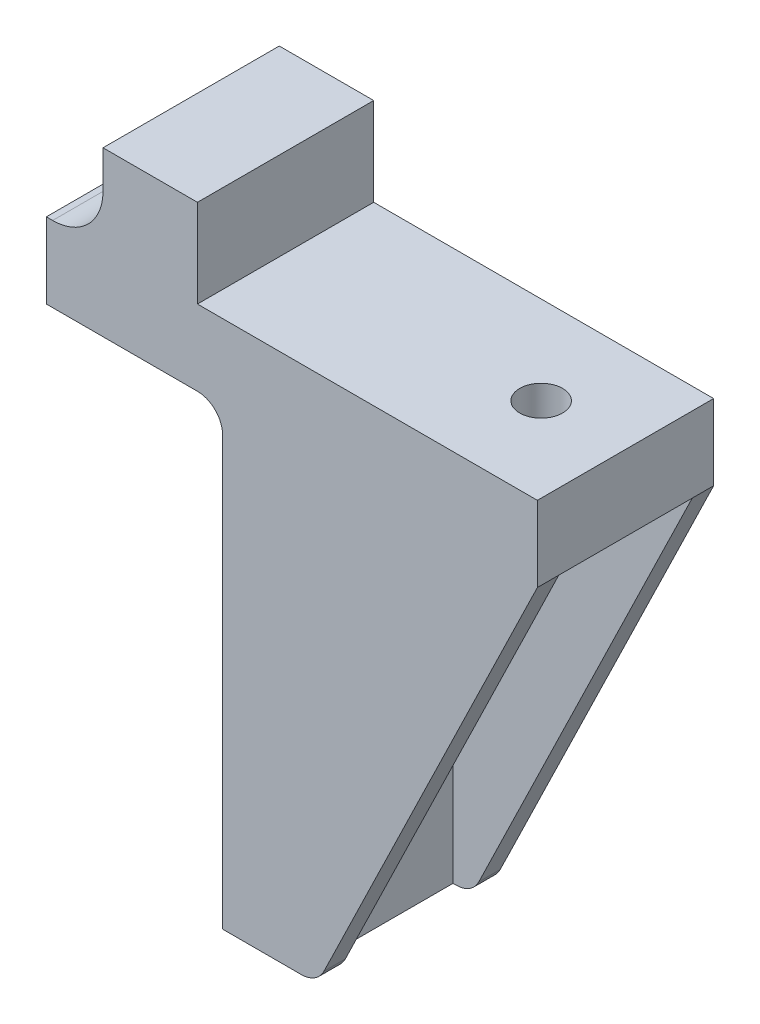
ISO-10303-21;
HEADER;
FILE_DESCRIPTION(('STEP AP214'),'2;1');
FILE_NAME('part.step','',(''),(''),'','','');
FILE_SCHEMA(('AUTOMOTIVE_DESIGN { 1 0 10303 214 1 1 1 1 }'));
ENDSEC;
DATA;
#1=APPLICATION_CONTEXT('core data for automotive mechanical design processes');
#2=APPLICATION_PROTOCOL_DEFINITION('international standard','automotive_design',2000,#1);
#3=PRODUCT_CONTEXT('',#1,'mechanical');
#4=PRODUCT('Part','Part','',(#3));
#5=PRODUCT_RELATED_PRODUCT_CATEGORY('part','',(#4));
#6=PRODUCT_DEFINITION_FORMATION('','',#4);
#7=PRODUCT_DEFINITION_CONTEXT('part definition',#1,'design');
#8=PRODUCT_DEFINITION('design','',#6,#7);
#9=PRODUCT_DEFINITION_SHAPE('','',#8);
#10=(LENGTH_UNIT() NAMED_UNIT(*) SI_UNIT(.MILLI.,.METRE.));
#11=(NAMED_UNIT(*) PLANE_ANGLE_UNIT() SI_UNIT($,.RADIAN.));
#12=(NAMED_UNIT(*) SI_UNIT($,.STERADIAN.) SOLID_ANGLE_UNIT());
#13=UNCERTAINTY_MEASURE_WITH_UNIT(LENGTH_MEASURE(1.E-05),#10,'distance_accuracy_value','');
#14=(GEOMETRIC_REPRESENTATION_CONTEXT(3) GLOBAL_UNCERTAINTY_ASSIGNED_CONTEXT((#13)) GLOBAL_UNIT_ASSIGNED_CONTEXT((#10,
#11,#12)) REPRESENTATION_CONTEXT('',''));
#15=CARTESIAN_POINT('',(0.,0.,0.));
#16=DIRECTION('',(0.,0.,1.));
#17=DIRECTION('',(1.,0.,0.));
#18=AXIS2_PLACEMENT_3D('',#15,#16,#17);
#19=CARTESIAN_POINT('',(0.,0.,14.));
#20=DIRECTION('',(0.,-1.,0.));
#21=DIRECTION('',(0.,0.,-1.));
#22=AXIS2_PLACEMENT_3D('',#19,#20,#21);
#23=PLANE('',#22);
#24=CARTESIAN_POINT('',(18.3,0.,7.));
#25=DIRECTION('',(0.,-1.,0.));
#26=DIRECTION('',(0.,0.,-1.));
#27=AXIS2_PLACEMENT_3D('',#24,#25,#26);
#28=CIRCLE('',#27,1.7);
#29=CARTESIAN_POINT('',(18.3,0.,5.3));
#30=VERTEX_POINT('',#29);
#31=EDGE_CURVE('E489',#30,#30,#28,.T.);
#32=ORIENTED_EDGE('',*,*,#31,.T.);
#33=EDGE_LOOP('',(#32));
#34=FACE_BOUND('',#33,.T.);
#35=DIRECTION('',(0.,0.,-1.));
#36=VECTOR('',#35,1.);
#37=CARTESIAN_POINT('',(-2.,0.,14.));
#38=LINE('',#37,#36);
#39=CARTESIAN_POINT('',(-2.,0.,14.));
#40=VERTEX_POINT('',#39);
#41=CARTESIAN_POINT('',(-2.,0.,0.));
#42=VERTEX_POINT('',#41);
#43=EDGE_CURVE('E226',#40,#42,#38,.T.);
#44=ORIENTED_EDGE('',*,*,#43,.F.);
#45=DIRECTION('',(-1.,0.,0.));
#46=VECTOR('',#45,1.);
#47=CARTESIAN_POINT('',(0.,0.,14.));
#48=LINE('',#47,#46);
#49=CARTESIAN_POINT('',(25.,0.,14.));
#50=VERTEX_POINT('',#49);
#51=EDGE_CURVE('E565',#50,#40,#48,.T.);
#52=ORIENTED_EDGE('',*,*,#51,.F.);
#53=DIRECTION('',(0.,0.,-1.));
#54=VECTOR('',#53,1.);
#55=CARTESIAN_POINT('',(25.,0.,14.));
#56=LINE('',#55,#54);
#57=CARTESIAN_POINT('',(25.,0.,0.));
#58=VERTEX_POINT('',#57);
#59=EDGE_CURVE('E498',#50,#58,#56,.T.);
#60=ORIENTED_EDGE('',*,*,#59,.T.);
#61=DIRECTION('',(-1.,0.,0.));
#62=VECTOR('',#61,1.);
#63=CARTESIAN_POINT('',(0.,0.,0.));
#64=LINE('',#63,#62);
#65=EDGE_CURVE('E333',#58,#42,#64,.T.);
#66=ORIENTED_EDGE('',*,*,#65,.T.);
#67=EDGE_LOOP('',(#44,#52,#60,#66));
#68=FACE_BOUND('',#67,.T.);
#69=ADVANCED_FACE('F49',(#34,#68),#23,.F.);
#70=CARTESIAN_POINT('',(6.,-6.,14.));
#71=DIRECTION('',(-1.,0.,0.));
#72=DIRECTION('',(0.,-1.,0.));
#73=AXIS2_PLACEMENT_3D('',#70,#71,#72);
#74=PLANE('',#73);
#75=CARTESIAN_POINT('',(5.99999999999999,-34.058,6.99999999999999));
#76=DIRECTION('',(1.,0.,0.));
#77=DIRECTION('',(0.,1.,0.));
#78=AXIS2_PLACEMENT_3D('',#75,#76,#77);
#79=CIRCLE('',#78,1.7);
#80=CARTESIAN_POINT('',(5.99999999999999,-32.358,6.99999999999999));
#81=VERTEX_POINT('',#80);
#82=EDGE_CURVE('E492',#81,#81,#79,.T.);
#83=ORIENTED_EDGE('',*,*,#82,.F.);
#84=EDGE_LOOP('',(#83));
#85=FACE_BOUND('',#84,.T.);
#86=CARTESIAN_POINT('',(5.99999999999999,-17.78,7.));
#87=DIRECTION('',(1.,0.,0.));
#88=DIRECTION('',(0.,1.,0.));
#89=AXIS2_PLACEMENT_3D('',#86,#87,#88);
#90=CIRCLE('',#89,1.7);
#91=CARTESIAN_POINT('',(5.99999999999999,-16.08,7.));
#92=VERTEX_POINT('',#91);
#93=EDGE_CURVE('E559',#92,#92,#90,.T.);
#94=ORIENTED_EDGE('',*,*,#93,.F.);
#95=EDGE_LOOP('',(#94));
#96=FACE_BOUND('',#95,.T.);
#97=DIRECTION('',(0.,-1.,0.));
#98=VECTOR('',#97,1.);
#99=CARTESIAN_POINT('',(6.,-6.,1.7));
#100=LINE('',#99,#98);
#101=CARTESIAN_POINT('',(6.,-14.,1.7));
#102=VERTEX_POINT('',#101);
#103=CARTESIAN_POINT('',(6.00000000000001,-42.,1.7));
#104=VERTEX_POINT('',#103);
#105=EDGE_CURVE('E239',#102,#104,#100,.T.);
#106=ORIENTED_EDGE('',*,*,#105,.F.);
#107=DIRECTION('',(0.,0.,-1.));
#108=VECTOR('',#107,1.);
#109=CARTESIAN_POINT('',(6.,-14.,12.3));
#110=LINE('',#109,#108);
#111=CARTESIAN_POINT('',(6.00000000000001,-14.,12.3));
#112=VERTEX_POINT('',#111);
#113=EDGE_CURVE('E257',#102,#112,#110,.F.);
#114=ORIENTED_EDGE('',*,*,#113,.T.);
#115=DIRECTION('',(0.,1.,0.));
#116=VECTOR('',#115,1.);
#117=CARTESIAN_POINT('',(6.00000000000001,-42.,12.3));
#118=LINE('',#117,#116);
#119=CARTESIAN_POINT('',(6.00000000000001,-42.,12.3));
#120=VERTEX_POINT('',#119);
#121=EDGE_CURVE('E324',#120,#112,#118,.T.);
#122=ORIENTED_EDGE('',*,*,#121,.F.);
#123=DIRECTION('',(0.,0.,-1.));
#124=VECTOR('',#123,1.);
#125=CARTESIAN_POINT('',(6.00000000000001,-42.,14.));
#126=LINE('',#125,#124);
#127=EDGE_CURVE('E337',#120,#104,#126,.T.);
#128=ORIENTED_EDGE('',*,*,#127,.T.);
#129=EDGE_LOOP('',(#106,#114,#122,#128));
#130=FACE_BOUND('',#129,.T.);
#131=ADVANCED_FACE('F297',(#85,#96,#130),#74,.F.);
#132=CARTESIAN_POINT('',(0.,-5.54716981132076,14.));
#133=DIRECTION('',(1.,0.,0.));
#134=DIRECTION('',(0.,1.,0.));
#135=AXIS2_PLACEMENT_3D('',#132,#133,#134);
#136=PLANE('',#135);
#137=CARTESIAN_POINT('',(0.,-34.058,6.99999999999999));
#138=DIRECTION('',(1.,0.,0.));
#139=DIRECTION('',(0.,1.,0.));
#140=AXIS2_PLACEMENT_3D('',#137,#138,#139);
#141=CIRCLE('',#140,1.7);
#142=CARTESIAN_POINT('',(0.,-32.358,6.99999999999999));
#143=VERTEX_POINT('',#142);
#144=EDGE_CURVE('E556',#143,#143,#141,.T.);
#145=ORIENTED_EDGE('',*,*,#144,.T.);
#146=EDGE_LOOP('',(#145));
#147=FACE_BOUND('',#146,.T.);
#148=CARTESIAN_POINT('',(0.,-17.78,7.));
#149=DIRECTION('',(1.,0.,0.));
#150=DIRECTION('',(0.,1.,0.));
#151=AXIS2_PLACEMENT_3D('',#148,#149,#150);
#152=CIRCLE('',#151,1.7);
#153=CARTESIAN_POINT('',(0.,-16.08,7.));
#154=VERTEX_POINT('',#153);
#155=EDGE_CURVE('E562',#154,#154,#152,.T.);
#156=ORIENTED_EDGE('',*,*,#155,.T.);
#157=EDGE_LOOP('',(#156));
#158=FACE_BOUND('',#157,.T.);
#159=DIRECTION('',(0.,-1.,0.));
#160=VECTOR('',#159,1.);
#161=CARTESIAN_POINT('',(0.,0.,14.));
#162=LINE('',#161,#160);
#163=CARTESIAN_POINT('',(0.,-8.,14.));
#164=VERTEX_POINT('',#163);
#165=CARTESIAN_POINT('',(0.,-42.,14.));
#166=VERTEX_POINT('',#165);
#167=EDGE_CURVE('E327',#164,#166,#162,.T.);
#168=ORIENTED_EDGE('',*,*,#167,.F.);
#169=DIRECTION('',(0.,0.,-1.));
#170=VECTOR('',#169,1.);
#171=CARTESIAN_POINT('',(0.,-8.,14.));
#172=LINE('',#171,#170);
#173=CARTESIAN_POINT('',(0.,-8.,0.));
#174=VERTEX_POINT('',#173);
#175=EDGE_CURVE('E485',#164,#174,#172,.T.);
#176=ORIENTED_EDGE('',*,*,#175,.T.);
#177=DIRECTION('',(0.,-1.,0.));
#178=VECTOR('',#177,1.);
#179=CARTESIAN_POINT('',(0.,-5.54716981132076,0.));
#180=LINE('',#179,#178);
#181=CARTESIAN_POINT('',(0.,-42.,0.));
#182=VERTEX_POINT('',#181);
#183=EDGE_CURVE('E507',#174,#182,#180,.T.);
#184=ORIENTED_EDGE('',*,*,#183,.T.);
#185=DIRECTION('',(0.,0.,-1.));
#186=VECTOR('',#185,1.);
#187=CARTESIAN_POINT('',(0.,-42.,14.));
#188=LINE('',#187,#186);
#189=EDGE_CURVE('E488',#166,#182,#188,.T.);
#190=ORIENTED_EDGE('',*,*,#189,.F.);
#191=EDGE_LOOP('',(#168,#176,#184,#190));
#192=FACE_BOUND('',#191,.T.);
#193=ADVANCED_FACE('F296',(#147,#158,#192),#136,.F.);
#194=CARTESIAN_POINT('',(0.,-42.,14.));
#195=DIRECTION('',(0.,1.,0.));
#196=DIRECTION('',(0.,0.,1.));
#197=AXIS2_PLACEMENT_3D('',#194,#195,#196);
#198=PLANE('',#197);
#199=DIRECTION('',(1.,0.,0.));
#200=VECTOR('',#199,1.);
#201=CARTESIAN_POINT('',(6.00000000000001,-42.,12.3));
#202=LINE('',#201,#200);
#203=CARTESIAN_POINT('',(6.24843804893052,-42.,12.3));
#204=VERTEX_POINT('',#203);
#205=EDGE_CURVE('E325',#120,#204,#202,.T.);
#206=ORIENTED_EDGE('',*,*,#205,.T.);
#207=DIRECTION('',(0.,0.,-1.));
#208=VECTOR('',#207,1.);
#209=CARTESIAN_POINT('',(6.24843804893052,-42.,14.));
#210=LINE('',#209,#208);
#211=CARTESIAN_POINT('',(6.24843804893052,-42.,14.));
#212=VERTEX_POINT('',#211);
#213=EDGE_CURVE('E59',#204,#212,#210,.F.);
#214=ORIENTED_EDGE('',*,*,#213,.T.);
#215=DIRECTION('',(1.,0.,0.));
#216=VECTOR('',#215,1.);
#217=CARTESIAN_POINT('',(6.,-42.,14.));
#218=LINE('',#217,#216);
#219=CARTESIAN_POINT('',(6.,-42.,14.));
#220=VERTEX_POINT('',#219);
#221=EDGE_CURVE('E53',#220,#212,#218,.T.);
#222=ORIENTED_EDGE('',*,*,#221,.F.);
#223=DIRECTION('',(1.,0.,0.));
#224=VECTOR('',#223,1.);
#225=CARTESIAN_POINT('',(0.,-42.,14.));
#226=LINE('',#225,#224);
#227=EDGE_CURVE('E321',#166,#220,#226,.T.);
#228=ORIENTED_EDGE('',*,*,#227,.F.);
#229=ORIENTED_EDGE('',*,*,#189,.T.);
#230=DIRECTION('',(1.,0.,0.));
#231=VECTOR('',#230,1.);
#232=CARTESIAN_POINT('',(0.,-42.,0.));
#233=LINE('',#232,#231);
#234=CARTESIAN_POINT('',(6.00000000000001,-42.,0.));
#235=VERTEX_POINT('',#234);
#236=EDGE_CURVE('E446',#182,#235,#233,.T.);
#237=ORIENTED_EDGE('',*,*,#236,.T.);
#238=DIRECTION('',(1.,0.,0.));
#239=VECTOR('',#238,1.);
#240=CARTESIAN_POINT('',(6.,-42.,0.));
#241=LINE('',#240,#239);
#242=CARTESIAN_POINT('',(6.24843804893051,-42.,0.));
#243=VERTEX_POINT('',#242);
#244=EDGE_CURVE('E443',#235,#243,#241,.T.);
#245=ORIENTED_EDGE('',*,*,#244,.T.);
#246=DIRECTION('',(0.,0.,1.));
#247=VECTOR('',#246,1.);
#248=CARTESIAN_POINT('',(6.24843804893051,-42.,14.));
#249=LINE('',#248,#247);
#250=CARTESIAN_POINT('',(6.24843804893051,-42.,1.7));
#251=VERTEX_POINT('',#250);
#252=EDGE_CURVE('E269',#243,#251,#249,.T.);
#253=ORIENTED_EDGE('',*,*,#252,.T.);
#254=DIRECTION('',(-1.,0.,0.));
#255=VECTOR('',#254,1.);
#256=CARTESIAN_POINT('',(6.,-42.,1.7));
#257=LINE('',#256,#255);
#258=EDGE_CURVE('E233',#251,#104,#257,.T.);
#259=ORIENTED_EDGE('',*,*,#258,.T.);
#260=ORIENTED_EDGE('',*,*,#127,.F.);
#261=EDGE_LOOP('',(#206,#214,#222,#228,#229,#237,#245,#253,#259,#260));
#262=FACE_BOUND('',#261,.T.);
#263=ADVANCED_FACE('F285',(#262),#198,.F.);
#264=CARTESIAN_POINT('',(6.,-6.,14.));
#265=DIRECTION('',(0.,1.,0.));
#266=DIRECTION('',(0.,0.,1.));
#267=AXIS2_PLACEMENT_3D('',#264,#265,#266);
#268=PLANE('',#267);
#269=CARTESIAN_POINT('',(18.3,-6.,7.));
#270=DIRECTION('',(0.,-1.,0.));
#271=DIRECTION('',(0.,0.,-1.));
#272=AXIS2_PLACEMENT_3D('',#269,#270,#271);
#273=CIRCLE('',#272,1.7);
#274=CARTESIAN_POINT('',(18.3,-6.,5.3));
#275=VERTEX_POINT('',#274);
#276=EDGE_CURVE('E493',#275,#275,#273,.T.);
#277=ORIENTED_EDGE('',*,*,#276,.F.);
#278=EDGE_LOOP('',(#277));
#279=FACE_BOUND('',#278,.T.);
#280=DIRECTION('',(1.,0.,0.));
#281=VECTOR('',#280,1.);
#282=CARTESIAN_POINT('',(6.00000000000001,-6.,12.3));
#283=LINE('',#282,#281);
#284=CARTESIAN_POINT('',(14.,-6.,12.3));
#285=VERTEX_POINT('',#284);
#286=CARTESIAN_POINT('',(25.,-6.,12.3));
#287=VERTEX_POINT('',#286);
#288=EDGE_CURVE('E343',#285,#287,#283,.T.);
#289=ORIENTED_EDGE('',*,*,#288,.F.);
#290=DIRECTION('',(0.,0.,-1.));
#291=VECTOR('',#290,1.);
#292=CARTESIAN_POINT('',(14.,-6.,1.7));
#293=LINE('',#292,#291);
#294=CARTESIAN_POINT('',(14.,-6.,1.7));
#295=VERTEX_POINT('',#294);
#296=EDGE_CURVE('E253',#285,#295,#293,.T.);
#297=ORIENTED_EDGE('',*,*,#296,.T.);
#298=DIRECTION('',(-1.,0.,0.));
#299=VECTOR('',#298,1.);
#300=CARTESIAN_POINT('',(6.,-6.,1.7));
#301=LINE('',#300,#299);
#302=CARTESIAN_POINT('',(25.,-6.,1.7));
#303=VERTEX_POINT('',#302);
#304=EDGE_CURVE('E228',#303,#295,#301,.T.);
#305=ORIENTED_EDGE('',*,*,#304,.F.);
#306=DIRECTION('',(0.,0.,-1.));
#307=VECTOR('',#306,1.);
#308=CARTESIAN_POINT('',(25.,-6.,14.));
#309=LINE('',#308,#307);
#310=EDGE_CURVE('E501',#287,#303,#309,.T.);
#311=ORIENTED_EDGE('',*,*,#310,.F.);
#312=EDGE_LOOP('',(#289,#297,#305,#311));
#313=FACE_BOUND('',#312,.T.);
#314=ADVANCED_FACE('F295',(#279,#313),#268,.F.);
#315=CARTESIAN_POINT('',(25.,0.,14.));
#316=DIRECTION('',(-1.,0.,0.));
#317=DIRECTION('',(0.,0.,1.));
#318=AXIS2_PLACEMENT_3D('',#315,#316,#317);
#319=PLANE('',#318);
#320=DIRECTION('',(0.,1.,0.));
#321=VECTOR('',#320,1.);
#322=CARTESIAN_POINT('',(25.,0.,0.));
#323=LINE('',#322,#321);
#324=CARTESIAN_POINT('',(25.,-6.,0.));
#325=VERTEX_POINT('',#324);
#326=EDGE_CURVE('E506',#325,#58,#323,.T.);
#327=ORIENTED_EDGE('',*,*,#326,.T.);
#328=ORIENTED_EDGE('',*,*,#59,.F.);
#329=DIRECTION('',(0.,1.,0.));
#330=VECTOR('',#329,1.);
#331=CARTESIAN_POINT('',(25.,0.,14.));
#332=LINE('',#331,#330);
#333=CARTESIAN_POINT('',(25.,-6.,14.));
#334=VERTEX_POINT('',#333);
#335=EDGE_CURVE('E329',#334,#50,#332,.T.);
#336=ORIENTED_EDGE('',*,*,#335,.F.);
#337=DIRECTION('',(0.,0.,1.));
#338=VECTOR('',#337,1.);
#339=CARTESIAN_POINT('',(25.,-6.,14.));
#340=LINE('',#339,#338);
#341=EDGE_CURVE('E504',#334,#287,#340,.F.);
#342=ORIENTED_EDGE('',*,*,#341,.T.);
#343=ORIENTED_EDGE('',*,*,#310,.T.);
#344=DIRECTION('',(0.,0.,1.));
#345=VECTOR('',#344,1.);
#346=CARTESIAN_POINT('',(25.,-6.,0.));
#347=LINE('',#346,#345);
#348=EDGE_CURVE('E252',#325,#303,#347,.T.);
#349=ORIENTED_EDGE('',*,*,#348,.F.);
#350=EDGE_LOOP('',(#327,#328,#336,#342,#343,#349));
#351=FACE_BOUND('',#350,.T.);
#352=ADVANCED_FACE('F525',(#351),#319,.F.);
#353=CARTESIAN_POINT('',(-13.5,0.,14.));
#354=VERTEX_POINT('',#353);
#355=CARTESIAN_POINT('',(-14.,0.,14.));
#356=VERTEX_POINT('',#355);
#357=EDGE_CURVE('E331',#354,#356,#48,.T.);
#358=ORIENTED_EDGE('',*,*,#357,.F.);
#359=DIRECTION('',(0.,0.,-1.));
#360=VECTOR('',#359,1.);
#361=CARTESIAN_POINT('',(-13.5,0.,14.));
#362=LINE('',#361,#360);
#363=CARTESIAN_POINT('',(-13.5,0.,0.));
#364=VERTEX_POINT('',#363);
#365=EDGE_CURVE('E261',#354,#364,#362,.T.);
#366=ORIENTED_EDGE('',*,*,#365,.T.);
#367=CARTESIAN_POINT('',(-14.,0.,0.));
#368=VERTEX_POINT('',#367);
#369=EDGE_CURVE('E511',#364,#368,#64,.T.);
#370=ORIENTED_EDGE('',*,*,#369,.T.);
#371=DIRECTION('',(0.,0.,-1.));
#372=VECTOR('',#371,1.);
#373=CARTESIAN_POINT('',(-14.,0.,14.));
#374=LINE('',#373,#372);
#375=EDGE_CURVE('E547',#356,#368,#374,.T.);
#376=ORIENTED_EDGE('',*,*,#375,.F.);
#377=EDGE_LOOP('',(#358,#366,#370,#376));
#378=FACE_BOUND('',#377,.T.);
#379=ADVANCED_FACE('F418',(#378),#23,.F.);
#380=CARTESIAN_POINT('',(0.,0.,14.));
#381=DIRECTION('',(0.,0.,1.));
#382=DIRECTION('',(1.,0.,0.));
#383=AXIS2_PLACEMENT_3D('',#380,#381,#382);
#384=PLANE('',#383);
#385=ORIENTED_EDGE('',*,*,#221,.T.);
#386=CARTESIAN_POINT('',(6.24843804893052,-40.,14.));
#387=DIRECTION('',(0.,0.,1.));
#388=DIRECTION('',(1.,0.,0.));
#389=AXIS2_PLACEMENT_3D('',#386,#387,#388);
#390=CIRCLE('',#389,2.);
#391=CARTESIAN_POINT('',(8.04717375720704,-40.8743854137455,14.));
#392=VERTEX_POINT('',#391);
#393=EDGE_CURVE('E12',#212,#392,#390,.T.);
#394=ORIENTED_EDGE('',*,*,#393,.T.);
#395=DIRECTION('',(0.437192706872766,0.899367854138263,0.));
#396=VECTOR('',#395,1.);
#397=CARTESIAN_POINT('',(7.50000000000001,-42.,14.));
#398=LINE('',#397,#396);
#399=EDGE_CURVE('E346',#392,#334,#398,.T.);
#400=ORIENTED_EDGE('',*,*,#399,.T.);
#401=ORIENTED_EDGE('',*,*,#335,.T.);
#402=ORIENTED_EDGE('',*,*,#51,.T.);
#403=DIRECTION('',(0.,-1.,0.));
#404=VECTOR('',#403,1.);
#405=CARTESIAN_POINT('',(-2.,0.,14.));
#406=LINE('',#405,#404);
#407=CARTESIAN_POINT('',(-2.,7.,14.));
#408=VERTEX_POINT('',#407);
#409=EDGE_CURVE('E213',#408,#40,#406,.T.);
#410=ORIENTED_EDGE('',*,*,#409,.F.);
#411=DIRECTION('',(1.,0.,0.));
#412=VECTOR('',#411,1.);
#413=CARTESIAN_POINT('',(-9.49999999999999,6.99999999999999,14.));
#414=LINE('',#413,#412);
#415=CARTESIAN_POINT('',(-9.49999999999999,6.99999999999999,14.));
#416=VERTEX_POINT('',#415);
#417=EDGE_CURVE('E204',#416,#408,#414,.T.);
#418=ORIENTED_EDGE('',*,*,#417,.F.);
#419=DIRECTION('',(0.,1.,0.));
#420=VECTOR('',#419,1.);
#421=CARTESIAN_POINT('',(-9.5,0.,14.));
#422=LINE('',#421,#420);
#423=CARTESIAN_POINT('',(-9.5,4.,14.));
#424=VERTEX_POINT('',#423);
#425=EDGE_CURVE('E193',#424,#416,#422,.T.);
#426=ORIENTED_EDGE('',*,*,#425,.F.);
#427=CARTESIAN_POINT('',(-13.5,4.,14.));
#428=DIRECTION('',(0.,0.,1.));
#429=DIRECTION('',(1.,0.,0.));
#430=AXIS2_PLACEMENT_3D('',#427,#428,#429);
#431=CIRCLE('',#430,4.);
#432=EDGE_CURVE('E267',#424,#354,#431,.F.);
#433=ORIENTED_EDGE('',*,*,#432,.T.);
#434=ORIENTED_EDGE('',*,*,#357,.T.);
#435=DIRECTION('',(0.,1.,0.));
#436=VECTOR('',#435,1.);
#437=CARTESIAN_POINT('',(-14.,0.,14.));
#438=LINE('',#437,#436);
#439=CARTESIAN_POINT('',(-14.,-6.,14.));
#440=VERTEX_POINT('',#439);
#441=EDGE_CURVE('E541',#440,#356,#438,.T.);
#442=ORIENTED_EDGE('',*,*,#441,.F.);
#443=DIRECTION('',(-1.,0.,0.));
#444=VECTOR('',#443,1.);
#445=CARTESIAN_POINT('',(0.,-6.,14.));
#446=LINE('',#445,#444);
#447=CARTESIAN_POINT('',(-2.,-6.,14.));
#448=VERTEX_POINT('',#447);
#449=EDGE_CURVE('E539',#448,#440,#446,.T.);
#450=ORIENTED_EDGE('',*,*,#449,.F.);
#451=CARTESIAN_POINT('',(-2.,-8.,14.));
#452=DIRECTION('',(0.,0.,1.));
#453=DIRECTION('',(1.,0.,0.));
#454=AXIS2_PLACEMENT_3D('',#451,#452,#453);
#455=CIRCLE('',#454,2.);
#456=EDGE_CURVE('E477',#448,#164,#455,.F.);
#457=ORIENTED_EDGE('',*,*,#456,.T.);
#458=ORIENTED_EDGE('',*,*,#167,.T.);
#459=ORIENTED_EDGE('',*,*,#227,.T.);
#460=EDGE_LOOP('',(#385,#394,#400,#401,#402,#410,#418,#426,#433,#434,#442,#450,#457,#458,#459));
#461=FACE_BOUND('',#460,.T.);
#462=ADVANCED_FACE('F216',(#461),#384,.T.);
#463=CARTESIAN_POINT('',(0.,0.,0.));
#464=DIRECTION('',(0.,0.,1.));
#465=DIRECTION('',(1.,0.,0.));
#466=AXIS2_PLACEMENT_3D('',#463,#464,#465);
#467=PLANE('',#466);
#468=DIRECTION('',(-0.437192706872767,-0.899367854138262,0.));
#469=VECTOR('',#468,1.);
#470=CARTESIAN_POINT('',(25.,-6.,0.));
#471=LINE('',#470,#469);
#472=CARTESIAN_POINT('',(8.04717375720703,-40.8743854137455,0.));
#473=VERTEX_POINT('',#472);
#474=EDGE_CURVE('E230',#325,#473,#471,.T.);
#475=ORIENTED_EDGE('',*,*,#474,.T.);
#476=CARTESIAN_POINT('',(6.24843804893051,-40.,0.));
#477=DIRECTION('',(0.,0.,1.));
#478=DIRECTION('',(1.,0.,0.));
#479=AXIS2_PLACEMENT_3D('',#476,#477,#478);
#480=CIRCLE('',#479,2.);
#481=EDGE_CURVE('E451',#473,#243,#480,.F.);
#482=ORIENTED_EDGE('',*,*,#481,.T.);
#483=ORIENTED_EDGE('',*,*,#244,.F.);
#484=ORIENTED_EDGE('',*,*,#236,.F.);
#485=ORIENTED_EDGE('',*,*,#183,.F.);
#486=CARTESIAN_POINT('',(-2.,-8.,0.));
#487=DIRECTION('',(0.,0.,1.));
#488=DIRECTION('',(1.,0.,0.));
#489=AXIS2_PLACEMENT_3D('',#486,#487,#488);
#490=CIRCLE('',#489,2.);
#491=CARTESIAN_POINT('',(-2.,-6.,0.));
#492=VERTEX_POINT('',#491);
#493=EDGE_CURVE('E478',#174,#492,#490,.T.);
#494=ORIENTED_EDGE('',*,*,#493,.T.);
#495=DIRECTION('',(-1.,0.,0.));
#496=VECTOR('',#495,1.);
#497=CARTESIAN_POINT('',(0.,-6.,0.));
#498=LINE('',#497,#496);
#499=CARTESIAN_POINT('',(-14.,-6.,0.));
#500=VERTEX_POINT('',#499);
#501=EDGE_CURVE('E345',#492,#500,#498,.T.);
#502=ORIENTED_EDGE('',*,*,#501,.T.);
#503=DIRECTION('',(0.,1.,0.));
#504=VECTOR('',#503,1.);
#505=CARTESIAN_POINT('',(-14.,0.,0.));
#506=LINE('',#505,#504);
#507=EDGE_CURVE('E350',#500,#368,#506,.T.);
#508=ORIENTED_EDGE('',*,*,#507,.T.);
#509=ORIENTED_EDGE('',*,*,#369,.F.);
#510=CARTESIAN_POINT('',(-13.5,4.,0.));
#511=DIRECTION('',(0.,0.,1.));
#512=DIRECTION('',(1.,0.,0.));
#513=AXIS2_PLACEMENT_3D('',#510,#511,#512);
#514=CIRCLE('',#513,4.);
#515=CARTESIAN_POINT('',(-9.5,4.,0.));
#516=VERTEX_POINT('',#515);
#517=EDGE_CURVE('E265',#364,#516,#514,.T.);
#518=ORIENTED_EDGE('',*,*,#517,.T.);
#519=DIRECTION('',(0.,1.,0.));
#520=VECTOR('',#519,1.);
#521=CARTESIAN_POINT('',(-9.5,0.,0.));
#522=LINE('',#521,#520);
#523=CARTESIAN_POINT('',(-9.49999999999999,6.99999999999999,0.));
#524=VERTEX_POINT('',#523);
#525=EDGE_CURVE('E221',#516,#524,#522,.T.);
#526=ORIENTED_EDGE('',*,*,#525,.T.);
#527=DIRECTION('',(1.,0.,0.));
#528=VECTOR('',#527,1.);
#529=CARTESIAN_POINT('',(-9.49999999999999,6.99999999999999,0.));
#530=LINE('',#529,#528);
#531=CARTESIAN_POINT('',(-2.,7.,0.));
#532=VERTEX_POINT('',#531);
#533=EDGE_CURVE('E211',#524,#532,#530,.T.);
#534=ORIENTED_EDGE('',*,*,#533,.T.);
#535=DIRECTION('',(0.,-1.,0.));
#536=VECTOR('',#535,1.);
#537=CARTESIAN_POINT('',(-2.,0.,0.));
#538=LINE('',#537,#536);
#539=EDGE_CURVE('E205',#532,#42,#538,.T.);
#540=ORIENTED_EDGE('',*,*,#539,.T.);
#541=ORIENTED_EDGE('',*,*,#65,.F.);
#542=ORIENTED_EDGE('',*,*,#326,.F.);
#543=EDGE_LOOP('',(#475,#482,#483,#484,#485,#494,#502,#508,#509,#518,#526,#534,#540,#541,#542));
#544=FACE_BOUND('',#543,.T.);
#545=ADVANCED_FACE('F413',(#544),#467,.F.);
#546=CARTESIAN_POINT('',(-4.00000000000001,-17.78,7.));
#547=DIRECTION('',(1.,0.,0.));
#548=DIRECTION('',(0.,1.,0.));
#549=AXIS2_PLACEMENT_3D('',#546,#547,#548);
#550=CYLINDRICAL_SURFACE('',#549,1.7);
#551=ORIENTED_EDGE('',*,*,#93,.T.);
#552=EDGE_LOOP('',(#551));
#553=FACE_BOUND('',#552,.T.);
#554=ORIENTED_EDGE('',*,*,#155,.F.);
#555=EDGE_LOOP('',(#554));
#556=FACE_BOUND('',#555,.T.);
#557=ADVANCED_FACE('F409',(#553,#556),#550,.F.);
#558=CARTESIAN_POINT('',(-4.00000000000001,-34.058,6.99999999999999));
#559=DIRECTION('',(1.,0.,0.));
#560=DIRECTION('',(0.,1.,0.));
#561=AXIS2_PLACEMENT_3D('',#558,#559,#560);
#562=CYLINDRICAL_SURFACE('',#561,1.7);
#563=ORIENTED_EDGE('',*,*,#82,.T.);
#564=EDGE_LOOP('',(#563));
#565=FACE_BOUND('',#564,.T.);
#566=ORIENTED_EDGE('',*,*,#144,.F.);
#567=EDGE_LOOP('',(#566));
#568=FACE_BOUND('',#567,.T.);
#569=ADVANCED_FACE('F405',(#565,#568),#562,.F.);
#570=CARTESIAN_POINT('',(18.3,4.,7.));
#571=DIRECTION('',(0.,-1.,0.));
#572=DIRECTION('',(0.,0.,-1.));
#573=AXIS2_PLACEMENT_3D('',#570,#571,#572);
#574=CYLINDRICAL_SURFACE('',#573,1.7);
#575=ORIENTED_EDGE('',*,*,#276,.T.);
#576=EDGE_LOOP('',(#575));
#577=FACE_BOUND('',#576,.T.);
#578=ORIENTED_EDGE('',*,*,#31,.F.);
#579=EDGE_LOOP('',(#578));
#580=FACE_BOUND('',#579,.T.);
#581=ADVANCED_FACE('F398',(#577,#580),#574,.F.);
#582=CARTESIAN_POINT('',(-14.,0.,14.));
#583=DIRECTION('',(-1.,0.,0.));
#584=DIRECTION('',(0.,0.,1.));
#585=AXIS2_PLACEMENT_3D('',#582,#583,#584);
#586=PLANE('',#585);
#587=ORIENTED_EDGE('',*,*,#507,.F.);
#588=DIRECTION('',(0.,0.,-1.));
#589=VECTOR('',#588,1.);
#590=CARTESIAN_POINT('',(-14.,-6.,14.));
#591=LINE('',#590,#589);
#592=EDGE_CURVE('E543',#440,#500,#591,.T.);
#593=ORIENTED_EDGE('',*,*,#592,.F.);
#594=ORIENTED_EDGE('',*,*,#441,.T.);
#595=ORIENTED_EDGE('',*,*,#375,.T.);
#596=EDGE_LOOP('',(#587,#593,#594,#595));
#597=FACE_BOUND('',#596,.T.);
#598=ADVANCED_FACE('F394',(#597),#586,.T.);
#599=CARTESIAN_POINT('',(0.,-6.,14.));
#600=DIRECTION('',(0.,-1.,0.));
#601=DIRECTION('',(0.,0.,-1.));
#602=AXIS2_PLACEMENT_3D('',#599,#600,#601);
#603=PLANE('',#602);
#604=ORIENTED_EDGE('',*,*,#501,.F.);
#605=DIRECTION('',(0.,0.,-1.));
#606=VECTOR('',#605,1.);
#607=CARTESIAN_POINT('',(-2.,-6.,14.));
#608=LINE('',#607,#606);
#609=EDGE_CURVE('E481',#492,#448,#608,.F.);
#610=ORIENTED_EDGE('',*,*,#609,.T.);
#611=ORIENTED_EDGE('',*,*,#449,.T.);
#612=ORIENTED_EDGE('',*,*,#592,.T.);
#613=EDGE_LOOP('',(#604,#610,#611,#612));
#614=FACE_BOUND('',#613,.T.);
#615=ADVANCED_FACE('F397',(#614),#603,.T.);
#616=CARTESIAN_POINT('',(-2.,-8.,14.));
#617=DIRECTION('',(0.,0.,-1.));
#618=DIRECTION('',(-1.,0.,0.));
#619=AXIS2_PLACEMENT_3D('',#616,#617,#618);
#620=CYLINDRICAL_SURFACE('',#619,2.);
#621=ORIENTED_EDGE('',*,*,#456,.F.);
#622=ORIENTED_EDGE('',*,*,#609,.F.);
#623=ORIENTED_EDGE('',*,*,#493,.F.);
#624=ORIENTED_EDGE('',*,*,#175,.F.);
#625=EDGE_LOOP('',(#621,#622,#623,#624));
#626=FACE_BOUND('',#625,.T.);
#627=ADVANCED_FACE('F388',(#626),#620,.F.);
#628=CARTESIAN_POINT('',(0.,0.,12.3));
#629=DIRECTION('',(0.,0.,-1.));
#630=DIRECTION('',(-1.,0.,0.));
#631=AXIS2_PLACEMENT_3D('',#628,#629,#630);
#632=PLANE('',#631);
#633=DIRECTION('',(0.437192706872766,0.899367854138263,0.));
#634=VECTOR('',#633,1.);
#635=CARTESIAN_POINT('',(7.50000000000001,-42.,12.3));
#636=LINE('',#635,#634);
#637=CARTESIAN_POINT('',(8.04717375720704,-40.8743854137455,12.3));
#638=VERTEX_POINT('',#637);
#639=EDGE_CURVE('E352',#638,#287,#636,.T.);
#640=ORIENTED_EDGE('',*,*,#639,.F.);
#641=CARTESIAN_POINT('',(6.24843804893052,-40.,12.3));
#642=DIRECTION('',(0.,0.,-1.));
#643=DIRECTION('',(-1.,0.,0.));
#644=AXIS2_PLACEMENT_3D('',#641,#642,#643);
#645=CIRCLE('',#644,2.);
#646=EDGE_CURVE('E74',#638,#204,#645,.T.);
#647=ORIENTED_EDGE('',*,*,#646,.T.);
#648=ORIENTED_EDGE('',*,*,#205,.F.);
#649=ORIENTED_EDGE('',*,*,#121,.T.);
#650=CARTESIAN_POINT('',(14.,-14.,12.3));
#651=DIRECTION('',(0.,0.,-1.));
#652=DIRECTION('',(-1.,0.,0.));
#653=AXIS2_PLACEMENT_3D('',#650,#651,#652);
#654=CIRCLE('',#653,8.);
#655=EDGE_CURVE('E259',#112,#285,#654,.T.);
#656=ORIENTED_EDGE('',*,*,#655,.T.);
#657=ORIENTED_EDGE('',*,*,#288,.T.);
#658=EDGE_LOOP('',(#640,#647,#648,#649,#656,#657));
#659=FACE_BOUND('',#658,.T.);
#660=ADVANCED_FACE('F377',(#659),#632,.T.);
#661=CARTESIAN_POINT('',(22.5807458261819,-10.9767514432829,0.));
#662=DIRECTION('',(-0.899367854138263,0.437192706872766,0.));
#663=DIRECTION('',(-0.437192706872766,-0.899367854138263,0.));
#664=AXIS2_PLACEMENT_3D('',#661,#662,#663);
#665=PLANE('',#664);
#666=ORIENTED_EDGE('',*,*,#399,.F.);
#667=DIRECTION('',(0.,0.,-1.));
#668=VECTOR('',#667,1.);
#669=CARTESIAN_POINT('',(8.04717375720705,-40.8743854137455,0.));
#670=LINE('',#669,#668);
#671=EDGE_CURVE('E361',#392,#638,#670,.T.);
#672=ORIENTED_EDGE('',*,*,#671,.T.);
#673=ORIENTED_EDGE('',*,*,#639,.T.);
#674=ORIENTED_EDGE('',*,*,#341,.F.);
#675=EDGE_LOOP('',(#666,#672,#673,#674));
#676=FACE_BOUND('',#675,.T.);
#677=ADVANCED_FACE('F387',(#676),#665,.F.);
#678=CARTESIAN_POINT('',(0.,0.,1.7));
#679=DIRECTION('',(0.,0.,-1.));
#680=DIRECTION('',(-1.,0.,0.));
#681=AXIS2_PLACEMENT_3D('',#678,#679,#680);
#682=PLANE('',#681);
#683=ORIENTED_EDGE('',*,*,#258,.F.);
#684=CARTESIAN_POINT('',(6.24843804893051,-40.,1.7));
#685=DIRECTION('',(0.,0.,-1.));
#686=DIRECTION('',(-1.,0.,0.));
#687=AXIS2_PLACEMENT_3D('',#684,#685,#686);
#688=CIRCLE('',#687,2.);
#689=CARTESIAN_POINT('',(8.04717375720703,-40.8743854137455,1.7));
#690=VERTEX_POINT('',#689);
#691=EDGE_CURVE('E452',#251,#690,#688,.F.);
#692=ORIENTED_EDGE('',*,*,#691,.T.);
#693=DIRECTION('',(-0.437192706872767,-0.899367854138262,0.));
#694=VECTOR('',#693,1.);
#695=CARTESIAN_POINT('',(25.,-6.,1.7));
#696=LINE('',#695,#694);
#697=EDGE_CURVE('E234',#303,#690,#696,.T.);
#698=ORIENTED_EDGE('',*,*,#697,.F.);
#699=ORIENTED_EDGE('',*,*,#304,.T.);
#700=CARTESIAN_POINT('',(14.,-14.,1.7));
#701=DIRECTION('',(0.,0.,-1.));
#702=DIRECTION('',(-1.,0.,0.));
#703=AXIS2_PLACEMENT_3D('',#700,#701,#702);
#704=CIRCLE('',#703,8.);
#705=EDGE_CURVE('E255',#295,#102,#704,.F.);
#706=ORIENTED_EDGE('',*,*,#705,.T.);
#707=ORIENTED_EDGE('',*,*,#105,.T.);
#708=EDGE_LOOP('',(#683,#692,#698,#699,#706,#707));
#709=FACE_BOUND('',#708,.T.);
#710=ADVANCED_FACE('F392',(#709),#682,.F.);
#711=CARTESIAN_POINT('',(22.5807458261819,-10.9767514432829,0.));
#712=DIRECTION('',(-0.899367854138263,0.437192706872767,0.));
#713=DIRECTION('',(-0.437192706872767,-0.899367854138263,0.));
#714=AXIS2_PLACEMENT_3D('',#711,#712,#713);
#715=PLANE('',#714);
#716=ORIENTED_EDGE('',*,*,#697,.T.);
#717=DIRECTION('',(0.,0.,1.));
#718=VECTOR('',#717,1.);
#719=CARTESIAN_POINT('',(8.04717375720704,-40.8743854137455,0.));
#720=LINE('',#719,#718);
#721=EDGE_CURVE('E453',#690,#473,#720,.F.);
#722=ORIENTED_EDGE('',*,*,#721,.T.);
#723=ORIENTED_EDGE('',*,*,#474,.F.);
#724=ORIENTED_EDGE('',*,*,#348,.T.);
#725=EDGE_LOOP('',(#716,#722,#723,#724));
#726=FACE_BOUND('',#725,.T.);
#727=ADVANCED_FACE('F389',(#726),#715,.F.);
#728=CARTESIAN_POINT('',(14.,-14.,14.));
#729=DIRECTION('',(0.,0.,1.));
#730=DIRECTION('',(1.,0.,0.));
#731=AXIS2_PLACEMENT_3D('',#728,#729,#730);
#732=CYLINDRICAL_SURFACE('',#731,8.);
#733=ORIENTED_EDGE('',*,*,#655,.F.);
#734=ORIENTED_EDGE('',*,*,#113,.F.);
#735=ORIENTED_EDGE('',*,*,#705,.F.);
#736=ORIENTED_EDGE('',*,*,#296,.F.);
#737=EDGE_LOOP('',(#733,#734,#735,#736));
#738=FACE_BOUND('',#737,.T.);
#739=ADVANCED_FACE('F473',(#738),#732,.F.);
#740=CARTESIAN_POINT('',(-9.5,0.,14.));
#741=DIRECTION('',(-1.,0.,0.));
#742=DIRECTION('',(0.,-1.,0.));
#743=AXIS2_PLACEMENT_3D('',#740,#741,#742);
#744=PLANE('',#743);
#745=ORIENTED_EDGE('',*,*,#525,.F.);
#746=DIRECTION('',(0.,0.,-1.));
#747=VECTOR('',#746,1.);
#748=CARTESIAN_POINT('',(-9.5,4.,14.));
#749=LINE('',#748,#747);
#750=EDGE_CURVE('E200',#516,#424,#749,.F.);
#751=ORIENTED_EDGE('',*,*,#750,.T.);
#752=ORIENTED_EDGE('',*,*,#425,.T.);
#753=DIRECTION('',(0.,0.,-1.));
#754=VECTOR('',#753,1.);
#755=CARTESIAN_POINT('',(-9.49999999999999,6.99999999999999,14.));
#756=LINE('',#755,#754);
#757=EDGE_CURVE('E197',#416,#524,#756,.T.);
#758=ORIENTED_EDGE('',*,*,#757,.T.);
#759=EDGE_LOOP('',(#745,#751,#752,#758));
#760=FACE_BOUND('',#759,.T.);
#761=ADVANCED_FACE('F196',(#760),#744,.T.);
#762=CARTESIAN_POINT('',(-2.,0.,14.));
#763=DIRECTION('',(1.,0.,0.));
#764=DIRECTION('',(0.,1.,0.));
#765=AXIS2_PLACEMENT_3D('',#762,#763,#764);
#766=PLANE('',#765);
#767=ORIENTED_EDGE('',*,*,#539,.F.);
#768=DIRECTION('',(0.,0.,-1.));
#769=VECTOR('',#768,1.);
#770=CARTESIAN_POINT('',(-2.,7.,14.));
#771=LINE('',#770,#769);
#772=EDGE_CURVE('E212',#408,#532,#771,.T.);
#773=ORIENTED_EDGE('',*,*,#772,.F.);
#774=ORIENTED_EDGE('',*,*,#409,.T.);
#775=ORIENTED_EDGE('',*,*,#43,.T.);
#776=EDGE_LOOP('',(#767,#773,#774,#775));
#777=FACE_BOUND('',#776,.T.);
#778=ADVANCED_FACE('F587',(#777),#766,.T.);
#779=CARTESIAN_POINT('',(-9.49999999999999,6.99999999999999,14.));
#780=DIRECTION('',(0.,1.,0.));
#781=DIRECTION('',(-1.,0.,0.));
#782=AXIS2_PLACEMENT_3D('',#779,#780,#781);
#783=PLANE('',#782);
#784=ORIENTED_EDGE('',*,*,#533,.F.);
#785=ORIENTED_EDGE('',*,*,#757,.F.);
#786=ORIENTED_EDGE('',*,*,#417,.T.);
#787=ORIENTED_EDGE('',*,*,#772,.T.);
#788=EDGE_LOOP('',(#784,#785,#786,#787));
#789=FACE_BOUND('',#788,.T.);
#790=ADVANCED_FACE('F209',(#789),#783,.T.);
#791=CARTESIAN_POINT('',(-13.5,4.,14.));
#792=DIRECTION('',(0.,0.,-1.));
#793=DIRECTION('',(-1.,0.,0.));
#794=AXIS2_PLACEMENT_3D('',#791,#792,#793);
#795=CYLINDRICAL_SURFACE('',#794,4.);
#796=ORIENTED_EDGE('',*,*,#432,.F.);
#797=ORIENTED_EDGE('',*,*,#750,.F.);
#798=ORIENTED_EDGE('',*,*,#517,.F.);
#799=ORIENTED_EDGE('',*,*,#365,.F.);
#800=EDGE_LOOP('',(#796,#797,#798,#799));
#801=FACE_BOUND('',#800,.T.);
#802=ADVANCED_FACE('F584',(#801),#795,.F.);
#803=CARTESIAN_POINT('',(6.24843804893051,-40.,14.));
#804=DIRECTION('',(0.,0.,1.));
#805=DIRECTION('',(1.,0.,0.));
#806=AXIS2_PLACEMENT_3D('',#803,#804,#805);
#807=CYLINDRICAL_SURFACE('',#806,2.);
#808=ORIENTED_EDGE('',*,*,#481,.F.);
#809=ORIENTED_EDGE('',*,*,#721,.F.);
#810=ORIENTED_EDGE('',*,*,#691,.F.);
#811=ORIENTED_EDGE('',*,*,#252,.F.);
#812=EDGE_LOOP('',(#808,#809,#810,#811));
#813=FACE_BOUND('',#812,.T.);
#814=ADVANCED_FACE('F449',(#813),#807,.T.);
#815=CARTESIAN_POINT('',(6.24843804893052,-40.,0.));
#816=DIRECTION('',(0.,0.,-1.));
#817=DIRECTION('',(-1.,0.,0.));
#818=AXIS2_PLACEMENT_3D('',#815,#816,#817);
#819=CYLINDRICAL_SURFACE('',#818,2.);
#820=ORIENTED_EDGE('',*,*,#393,.F.);
#821=ORIENTED_EDGE('',*,*,#213,.F.);
#822=ORIENTED_EDGE('',*,*,#646,.F.);
#823=ORIENTED_EDGE('',*,*,#671,.F.);
#824=EDGE_LOOP('',(#820,#821,#822,#823));
#825=FACE_BOUND('',#824,.T.);
#826=ADVANCED_FACE('F51',(#825),#819,.T.);
#827=CLOSED_SHELL('',(#69,#131,#193,#263,#314,#352,#379,#462,#545,#557,#569,#581,#598,#615,#627,
#660,#677,#710,#727,#739,#761,#778,#790,#802,#814,#826));
#828=MANIFOLD_SOLID_BREP('B2',#827);
#829=ADVANCED_BREP_SHAPE_REPRESENTATION('',(#18,#828),#14);
#830=SHAPE_DEFINITION_REPRESENTATION(#9,#829);
ENDSEC;
END-ISO-10303-21;
